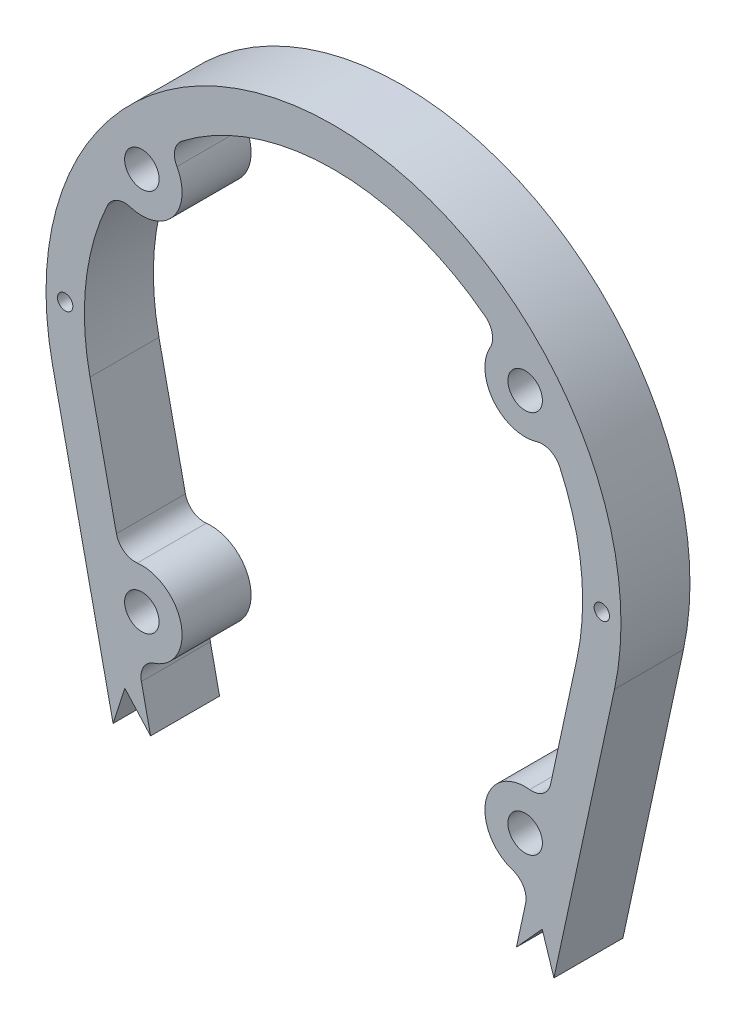
ISO-10303-21;
HEADER;
FILE_DESCRIPTION(('STEP AP214'),'2;1');
FILE_NAME('part.step','',(''),(''),'','','');
FILE_SCHEMA(('AUTOMOTIVE_DESIGN { 1 0 10303 214 1 1 1 1 }'));
ENDSEC;
DATA;
#1=APPLICATION_CONTEXT('core data for automotive mechanical design processes');
#2=APPLICATION_PROTOCOL_DEFINITION('international standard','automotive_design',2000,#1);
#3=PRODUCT_CONTEXT('',#1,'mechanical');
#4=PRODUCT('Part','Part','',(#3));
#5=PRODUCT_RELATED_PRODUCT_CATEGORY('part','',(#4));
#6=PRODUCT_DEFINITION_FORMATION('','',#4);
#7=PRODUCT_DEFINITION_CONTEXT('part definition',#1,'design');
#8=PRODUCT_DEFINITION('design','',#6,#7);
#9=PRODUCT_DEFINITION_SHAPE('','',#8);
#10=(LENGTH_UNIT() NAMED_UNIT(*) SI_UNIT(.MILLI.,.METRE.));
#11=(NAMED_UNIT(*) PLANE_ANGLE_UNIT() SI_UNIT($,.RADIAN.));
#12=(NAMED_UNIT(*) SI_UNIT($,.STERADIAN.) SOLID_ANGLE_UNIT());
#13=UNCERTAINTY_MEASURE_WITH_UNIT(LENGTH_MEASURE(1.E-05),#10,'distance_accuracy_value','');
#14=(GEOMETRIC_REPRESENTATION_CONTEXT(3) GLOBAL_UNCERTAINTY_ASSIGNED_CONTEXT((#13)) GLOBAL_UNIT_ASSIGNED_CONTEXT((#10,
#11,#12)) REPRESENTATION_CONTEXT('',''));
#15=CARTESIAN_POINT('',(0.,0.,0.));
#16=DIRECTION('',(0.,0.,1.));
#17=DIRECTION('',(1.,0.,0.));
#18=AXIS2_PLACEMENT_3D('',#15,#16,#17);
#19=CARTESIAN_POINT('',(-31.9298733487398,-112.5,18.));
#20=DIRECTION('',(0.,0.,1.));
#21=DIRECTION('',(1.,0.,0.));
#22=AXIS2_PLACEMENT_3D('',#19,#20,#21);
#23=PLANE('',#22);
#24=CARTESIAN_POINT('',(70.,47.5,18.));
#25=DIRECTION('',(0.,0.,1.));
#26=DIRECTION('',(1.,0.,0.));
#27=AXIS2_PLACEMENT_3D('',#24,#25,#26);
#28=CIRCLE('',#27,2.);
#29=CARTESIAN_POINT('',(72.,47.5,18.));
#30=VERTEX_POINT('',#29);
#31=EDGE_CURVE('E556',#30,#30,#28,.T.);
#32=ORIENTED_EDGE('',*,*,#31,.F.);
#33=EDGE_LOOP('',(#32));
#34=FACE_BOUND('',#33,.T.);
#35=CARTESIAN_POINT('',(-70.,47.5,18.));
#36=DIRECTION('',(0.,0.,1.));
#37=DIRECTION('',(1.,0.,0.));
#38=AXIS2_PLACEMENT_3D('',#35,#36,#37);
#39=CIRCLE('',#38,2.);
#40=CARTESIAN_POINT('',(-68.,47.5,18.));
#41=VERTEX_POINT('',#40);
#42=EDGE_CURVE('E550',#41,#41,#39,.T.);
#43=ORIENTED_EDGE('',*,*,#42,.F.);
#44=EDGE_LOOP('',(#43));
#45=FACE_BOUND('',#44,.T.);
#46=DIRECTION('',(-0.306753150837407,-0.95178910713,0.));
#47=VECTOR('',#46,1.);
#48=CARTESIAN_POINT('',(-57.5063561450649,-41.4755483598365,18.));
#49=LINE('',#48,#47);
#50=CARTESIAN_POINT('',(-54.4439824625953,-31.9736609139237,18.));
#51=VERTEX_POINT('',#50);
#52=CARTESIAN_POINT('',(-57.5063561450649,-41.4755483598365,18.));
#53=VERTEX_POINT('',#52);
#54=EDGE_CURVE('E215',#51,#53,#49,.T.);
#55=ORIENTED_EDGE('',*,*,#54,.F.);
#56=DIRECTION('',(-0.67089697040122,0.741550574881083,0.));
#57=VECTOR('',#56,1.);
#58=CARTESIAN_POINT('',(-54.4439824625953,-31.9736609139237,18.));
#59=LINE('',#58,#57);
#60=CARTESIAN_POINT('',(-47.7236876934698,-39.4016843948391,18.));
#61=VERTEX_POINT('',#60);
#62=EDGE_CURVE('E541',#61,#51,#59,.T.);
#63=ORIENTED_EDGE('',*,*,#62,.F.);
#64=DIRECTION('',(0.211189373172623,-0.977445164016353,0.));
#65=VECTOR('',#64,1.);
#66=CARTESIAN_POINT('',(-31.9298733487398,-112.5,18.));
#67=LINE('',#66,#65);
#68=CARTESIAN_POINT('',(-50.1212592306133,-28.3050337009208,18.));
#69=VERTEX_POINT('',#68);
#70=EDGE_CURVE('E361',#69,#61,#67,.T.);
#71=ORIENTED_EDGE('',*,*,#70,.F.);
#72=CARTESIAN_POINT('',(-45.2340334105316,-27.2490868350576,18.));
#73=DIRECTION('',(0.,0.,1.));
#74=DIRECTION('',(1.,0.,0.));
#75=AXIS2_PLACEMENT_3D('',#72,#73,#74);
#76=CIRCLE('',#75,5.);
#77=CARTESIAN_POINT('',(-46.7714419877795,-22.4913168882649,18.));
#78=VERTEX_POINT('',#77);
#79=EDGE_CURVE('E303',#69,#78,#76,.F.);
#80=ORIENTED_EDGE('',*,*,#79,.T.);
#81=CARTESIAN_POINT('',(-50.,-12.5,18.));
#82=DIRECTION('',(0.,0.,-1.));
#83=DIRECTION('',(1.,0.,0.));
#84=AXIS2_PLACEMENT_3D('',#81,#82,#83);
#85=CIRCLE('',#84,10.5);
#86=CARTESIAN_POINT('',(-51.1843712947804,-2.06701075261266,18.));
#87=VERTEX_POINT('',#86);
#88=EDGE_CURVE('E358',#87,#78,#85,.T.);
#89=ORIENTED_EDGE('',*,*,#88,.F.);
#90=CARTESIAN_POINT('',(-51.7483576256283,2.90107936519085,18.));
#91=DIRECTION('',(0.,0.,1.));
#92=DIRECTION('',(1.,0.,0.));
#93=AXIS2_PLACEMENT_3D('',#90,#91,#92);
#94=CIRCLE('',#93,5.);
#95=CARTESIAN_POINT('',(-56.63558344571,1.84513249932773,18.));
#96=VERTEX_POINT('',#95);
#97=EDGE_CURVE('E290',#87,#96,#94,.F.);
#98=ORIENTED_EDGE('',*,*,#97,.T.);
#99=DIRECTION('',(0.211189373172623,-0.977445164016353,0.));
#100=VECTOR('',#99,1.);
#101=CARTESIAN_POINT('',(-55.4723236772757,-3.53876830055558,18.));
#102=LINE('',#101,#100);
#103=CARTESIAN_POINT('',(-63.5339356610629,33.7726907437795,18.));
#104=VERTEX_POINT('',#103);
#105=EDGE_CURVE('E349',#104,#96,#102,.T.);
#106=ORIENTED_EDGE('',*,*,#105,.F.);
#107=CARTESIAN_POINT('',(0.,47.5,18.));
#108=DIRECTION('',(0.,0.,1.));
#109=DIRECTION('',(1.,0.,0.));
#110=AXIS2_PLACEMENT_3D('',#107,#108,#109);
#111=CIRCLE('',#110,65.);
#112=CARTESIAN_POINT('',(-59.0097536999229,74.755255791763,18.));
#113=VERTEX_POINT('',#112);
#114=EDGE_CURVE('E343',#113,#104,#111,.T.);
#115=ORIENTED_EDGE('',*,*,#114,.F.);
#116=CARTESIAN_POINT('',(-54.4705418768519,72.6586976539351,18.));
#117=DIRECTION('',(0.,0.,1.));
#118=DIRECTION('',(1.,0.,0.));
#119=AXIS2_PLACEMENT_3D('',#116,#117,#118);
#120=CIRCLE('',#119,5.);
#121=CARTESIAN_POINT('',(-53.0284315939965,77.4462145397625,18.));
#122=VERTEX_POINT('',#121);
#123=EDGE_CURVE('E11',#113,#122,#120,.F.);
#124=ORIENTED_EDGE('',*,*,#123,.T.);
#125=CARTESIAN_POINT('',(-50.,87.5,18.));
#126=DIRECTION('',(0.,0.,-1.));
#127=DIRECTION('',(1.,0.,0.));
#128=AXIS2_PLACEMENT_3D('',#125,#126,#127);
#129=CIRCLE('',#128,10.5);
#130=CARTESIAN_POINT('',(-40.8562064862553,92.661495924439,18.));
#131=VERTEX_POINT('',#130);
#132=EDGE_CURVE('E340',#131,#122,#129,.T.);
#133=ORIENTED_EDGE('',*,*,#132,.F.);
#134=CARTESIAN_POINT('',(-36.5020190987578,95.1193511265528,18.));
#135=DIRECTION('',(0.,0.,1.));
#136=DIRECTION('',(1.,0.,0.));
#137=AXIS2_PLACEMENT_3D('',#134,#135,#136);
#138=CIRCLE('',#137,5.);
#139=CARTESIAN_POINT('',(-39.5438540236543,99.0876303870988,18.));
#140=VERTEX_POINT('',#139);
#141=EDGE_CURVE('E315',#131,#140,#138,.F.);
#142=ORIENTED_EDGE('',*,*,#141,.T.);
#143=CARTESIAN_POINT('',(0.,47.5,18.));
#144=DIRECTION('',(0.,0.,1.));
#145=DIRECTION('',(1.,0.,0.));
#146=AXIS2_PLACEMENT_3D('',#143,#144,#145);
#147=CIRCLE('',#146,65.);
#148=CARTESIAN_POINT('',(39.5438540236543,99.0876303870988,18.));
#149=VERTEX_POINT('',#148);
#150=EDGE_CURVE('E347',#149,#140,#147,.T.);
#151=ORIENTED_EDGE('',*,*,#150,.F.);
#152=CARTESIAN_POINT('',(36.5020190987578,95.1193511265527,18.));
#153=DIRECTION('',(0.,0.,1.));
#154=DIRECTION('',(1.,0.,0.));
#155=AXIS2_PLACEMENT_3D('',#152,#153,#154);
#156=CIRCLE('',#155,5.);
#157=CARTESIAN_POINT('',(40.8562064862553,92.6614959244389,18.));
#158=VERTEX_POINT('',#157);
#159=EDGE_CURVE('E311',#149,#158,#156,.F.);
#160=ORIENTED_EDGE('',*,*,#159,.T.);
#161=CARTESIAN_POINT('',(50.,87.5,18.));
#162=DIRECTION('',(0.,0.,-1.));
#163=DIRECTION('',(1.,0.,0.));
#164=AXIS2_PLACEMENT_3D('',#161,#162,#163);
#165=CIRCLE('',#164,10.5);
#166=CARTESIAN_POINT('',(53.0284315939965,77.4462145397625,18.));
#167=VERTEX_POINT('',#166);
#168=EDGE_CURVE('E352',#167,#158,#165,.T.);
#169=ORIENTED_EDGE('',*,*,#168,.F.);
#170=CARTESIAN_POINT('',(54.470541876852,72.6586976539351,18.));
#171=DIRECTION('',(0.,0.,1.));
#172=DIRECTION('',(1.,0.,0.));
#173=AXIS2_PLACEMENT_3D('',#170,#171,#172);
#174=CIRCLE('',#173,5.);
#175=CARTESIAN_POINT('',(59.009753699923,74.755255791763,18.));
#176=VERTEX_POINT('',#175);
#177=EDGE_CURVE('E307',#167,#176,#174,.F.);
#178=ORIENTED_EDGE('',*,*,#177,.T.);
#179=CARTESIAN_POINT('',(0.,47.5,18.));
#180=DIRECTION('',(0.,0.,1.));
#181=DIRECTION('',(1.,0.,0.));
#182=AXIS2_PLACEMENT_3D('',#179,#180,#181);
#183=CIRCLE('',#182,65.);
#184=CARTESIAN_POINT('',(63.5339356610629,33.7726907437795,18.));
#185=VERTEX_POINT('',#184);
#186=EDGE_CURVE('E443',#185,#176,#183,.T.);
#187=ORIENTED_EDGE('',*,*,#186,.F.);
#188=DIRECTION('',(0.211189373172623,0.977445164016353,0.));
#189=VECTOR('',#188,1.);
#190=CARTESIAN_POINT('',(55.4723236772757,-3.53876830055554,18.));
#191=LINE('',#190,#189);
#192=CARTESIAN_POINT('',(56.63558344571,1.84513249932773,18.));
#193=VERTEX_POINT('',#192);
#194=EDGE_CURVE('E441',#193,#185,#191,.T.);
#195=ORIENTED_EDGE('',*,*,#194,.F.);
#196=CARTESIAN_POINT('',(51.7483576256282,2.90107936519085,18.));
#197=DIRECTION('',(0.,0.,1.));
#198=DIRECTION('',(1.,0.,0.));
#199=AXIS2_PLACEMENT_3D('',#196,#197,#198);
#200=CIRCLE('',#199,5.);
#201=CARTESIAN_POINT('',(51.1843712947804,-2.06701075261265,18.));
#202=VERTEX_POINT('',#201);
#203=EDGE_CURVE('E294',#193,#202,#200,.F.);
#204=ORIENTED_EDGE('',*,*,#203,.T.);
#205=CARTESIAN_POINT('',(50.,-12.5,18.));
#206=DIRECTION('',(0.,0.,-1.));
#207=DIRECTION('',(1.,0.,0.));
#208=AXIS2_PLACEMENT_3D('',#205,#206,#207);
#209=CIRCLE('',#208,10.5);
#210=CARTESIAN_POINT('',(46.7714419877795,-22.4913168882648,18.));
#211=VERTEX_POINT('',#210);
#212=EDGE_CURVE('E391',#211,#202,#209,.T.);
#213=ORIENTED_EDGE('',*,*,#212,.F.);
#214=CARTESIAN_POINT('',(45.2340334105316,-27.2490868350576,18.));
#215=DIRECTION('',(0.,0.,1.));
#216=DIRECTION('',(1.,0.,0.));
#217=AXIS2_PLACEMENT_3D('',#214,#215,#216);
#218=CIRCLE('',#217,5.);
#219=CARTESIAN_POINT('',(50.1212592306133,-28.3050337009207,18.));
#220=VERTEX_POINT('',#219);
#221=EDGE_CURVE('E298',#211,#220,#218,.F.);
#222=ORIENTED_EDGE('',*,*,#221,.T.);
#223=DIRECTION('',(0.211189373172623,0.977445164016353,0.));
#224=VECTOR('',#223,1.);
#225=CARTESIAN_POINT('',(31.9298733487398,-112.5,18.));
#226=LINE('',#225,#224);
#227=CARTESIAN_POINT('',(47.7244032118376,-39.3983727700264,18.));
#228=VERTEX_POINT('',#227);
#229=EDGE_CURVE('E364',#228,#220,#226,.T.);
#230=ORIENTED_EDGE('',*,*,#229,.F.);
#231=DIRECTION('',(-0.670959777554308,-0.741493747043273,0.));
#232=VECTOR('',#231,1.);
#233=CARTESIAN_POINT('',(47.7244032118376,-39.3983727700264,18.));
#234=LINE('',#233,#232);
#235=CARTESIAN_POINT('',(54.4443390688109,-31.9720104377862,18.));
#236=VERTEX_POINT('',#235);
#237=EDGE_CURVE('E55',#236,#228,#234,.T.);
#238=ORIENTED_EDGE('',*,*,#237,.F.);
#239=DIRECTION('',(-0.306672532909785,0.951815085801174,0.));
#240=VECTOR('',#239,1.);
#241=CARTESIAN_POINT('',(54.4443390688109,-31.9720104377862,18.));
#242=LINE('',#241,#240);
#243=CARTESIAN_POINT('',(57.5063561450649,-41.4755483598365,18.));
#244=VERTEX_POINT('',#243);
#245=EDGE_CURVE('E540',#244,#236,#242,.T.);
#246=ORIENTED_EDGE('',*,*,#245,.F.);
#247=DIRECTION('',(0.211189373172623,0.977445164016353,0.));
#248=VECTOR('',#247,1.);
#249=CARTESIAN_POINT('',(41.7043249889033,-114.611893731726,18.));
#250=LINE('',#249,#248);
#251=CARTESIAN_POINT('',(73.3083873012265,31.6607970120533,18.));
#252=VERTEX_POINT('',#251);
#253=EDGE_CURVE('E223',#244,#252,#250,.T.);
#254=ORIENTED_EDGE('',*,*,#253,.T.);
#255=CARTESIAN_POINT('',(0.,47.5,18.));
#256=DIRECTION('',(0.,0.,1.));
#257=DIRECTION('',(1.,0.,0.));
#258=AXIS2_PLACEMENT_3D('',#255,#256,#257);
#259=CIRCLE('',#258,75.);
#260=CARTESIAN_POINT('',(-73.3083873012264,31.6607970120533,18.));
#261=VERTEX_POINT('',#260);
#262=EDGE_CURVE('E416',#252,#261,#259,.T.);
#263=ORIENTED_EDGE('',*,*,#262,.T.);
#264=DIRECTION('',(0.211189373172623,-0.977445164016353,0.));
#265=VECTOR('',#264,1.);
#266=CARTESIAN_POINT('',(-73.3083873012264,31.6607970120533,18.));
#267=LINE('',#266,#265);
#268=EDGE_CURVE('E238',#261,#53,#267,.T.);
#269=ORIENTED_EDGE('',*,*,#268,.T.);
#270=EDGE_LOOP('',(#55,#63,#71,#80,#89,#98,#106,#115,#124,#133,#142,#151,#160,#169,#178,#187,
#195,#204,#213,#222,#230,#238,#246,#254,#263,#269));
#271=FACE_BOUND('',#270,.T.);
#272=CARTESIAN_POINT('',(-50.,87.5,18.));
#273=DIRECTION('',(0.,0.,1.));
#274=DIRECTION('',(1.,0.,0.));
#275=AXIS2_PLACEMENT_3D('',#272,#273,#274);
#276=CIRCLE('',#275,4.5);
#277=CARTESIAN_POINT('',(-45.5,87.5,18.));
#278=VERTEX_POINT('',#277);
#279=EDGE_CURVE('E403',#278,#278,#276,.T.);
#280=ORIENTED_EDGE('',*,*,#279,.F.);
#281=EDGE_LOOP('',(#280));
#282=FACE_BOUND('',#281,.T.);
#283=CARTESIAN_POINT('',(50.,-12.5,18.));
#284=DIRECTION('',(0.,0.,1.));
#285=DIRECTION('',(1.,0.,0.));
#286=AXIS2_PLACEMENT_3D('',#283,#284,#285);
#287=CIRCLE('',#286,4.5);
#288=CARTESIAN_POINT('',(54.5,-12.5,18.));
#289=VERTEX_POINT('',#288);
#290=EDGE_CURVE('E230',#289,#289,#287,.T.);
#291=ORIENTED_EDGE('',*,*,#290,.F.);
#292=EDGE_LOOP('',(#291));
#293=FACE_BOUND('',#292,.T.);
#294=CARTESIAN_POINT('',(50.,87.5,18.));
#295=DIRECTION('',(0.,0.,1.));
#296=DIRECTION('',(1.,0.,0.));
#297=AXIS2_PLACEMENT_3D('',#294,#295,#296);
#298=CIRCLE('',#297,4.5);
#299=CARTESIAN_POINT('',(54.5,87.5,18.));
#300=VERTEX_POINT('',#299);
#301=EDGE_CURVE('E409',#300,#300,#298,.T.);
#302=ORIENTED_EDGE('',*,*,#301,.F.);
#303=EDGE_LOOP('',(#302));
#304=FACE_BOUND('',#303,.T.);
#305=CARTESIAN_POINT('',(-50.,-12.5,18.));
#306=DIRECTION('',(0.,0.,1.));
#307=DIRECTION('',(1.,0.,0.));
#308=AXIS2_PLACEMENT_3D('',#305,#306,#307);
#309=CIRCLE('',#308,4.5);
#310=CARTESIAN_POINT('',(-45.5,-12.5,18.));
#311=VERTEX_POINT('',#310);
#312=EDGE_CURVE('E397',#311,#311,#309,.T.);
#313=ORIENTED_EDGE('',*,*,#312,.F.);
#314=EDGE_LOOP('',(#313));
#315=FACE_BOUND('',#314,.T.);
#316=ADVANCED_FACE('F32',(#34,#45,#271,#282,#293,#304,#315),#23,.T.);
#317=CARTESIAN_POINT('',(-31.9298733487398,-112.5,0.));
#318=DIRECTION('',(0.,0.,1.));
#319=DIRECTION('',(1.,0.,0.));
#320=AXIS2_PLACEMENT_3D('',#317,#318,#319);
#321=PLANE('',#320);
#322=CARTESIAN_POINT('',(70.,47.5,0.));
#323=DIRECTION('',(0.,0.,1.));
#324=DIRECTION('',(1.,0.,0.));
#325=AXIS2_PLACEMENT_3D('',#322,#323,#324);
#326=CIRCLE('',#325,2.);
#327=CARTESIAN_POINT('',(72.,47.5,0.));
#328=VERTEX_POINT('',#327);
#329=EDGE_CURVE('E553',#328,#328,#326,.T.);
#330=ORIENTED_EDGE('',*,*,#329,.T.);
#331=EDGE_LOOP('',(#330));
#332=FACE_BOUND('',#331,.T.);
#333=CARTESIAN_POINT('',(-70.,47.5,0.));
#334=DIRECTION('',(0.,0.,1.));
#335=DIRECTION('',(1.,0.,0.));
#336=AXIS2_PLACEMENT_3D('',#333,#334,#335);
#337=CIRCLE('',#336,2.);
#338=CARTESIAN_POINT('',(-68.,47.5,0.));
#339=VERTEX_POINT('',#338);
#340=EDGE_CURVE('E544',#339,#339,#337,.T.);
#341=ORIENTED_EDGE('',*,*,#340,.T.);
#342=EDGE_LOOP('',(#341));
#343=FACE_BOUND('',#342,.T.);
#344=CARTESIAN_POINT('',(-50.,-12.5,0.));
#345=DIRECTION('',(0.,0.,1.));
#346=DIRECTION('',(1.,0.,0.));
#347=AXIS2_PLACEMENT_3D('',#344,#345,#346);
#348=CIRCLE('',#347,4.5);
#349=CARTESIAN_POINT('',(-45.5,-12.5,0.));
#350=VERTEX_POINT('',#349);
#351=EDGE_CURVE('E396',#350,#350,#348,.T.);
#352=ORIENTED_EDGE('',*,*,#351,.T.);
#353=EDGE_LOOP('',(#352));
#354=FACE_BOUND('',#353,.T.);
#355=CARTESIAN_POINT('',(-50.,87.5,0.));
#356=DIRECTION('',(0.,0.,1.));
#357=DIRECTION('',(1.,0.,0.));
#358=AXIS2_PLACEMENT_3D('',#355,#356,#357);
#359=CIRCLE('',#358,4.5);
#360=CARTESIAN_POINT('',(-45.5,87.5,0.));
#361=VERTEX_POINT('',#360);
#362=EDGE_CURVE('E400',#361,#361,#359,.T.);
#363=ORIENTED_EDGE('',*,*,#362,.T.);
#364=EDGE_LOOP('',(#363));
#365=FACE_BOUND('',#364,.T.);
#366=CARTESIAN_POINT('',(50.,87.5,0.));
#367=DIRECTION('',(0.,0.,1.));
#368=DIRECTION('',(1.,0.,0.));
#369=AXIS2_PLACEMENT_3D('',#366,#367,#368);
#370=CIRCLE('',#369,4.5);
#371=CARTESIAN_POINT('',(54.5,87.5,0.));
#372=VERTEX_POINT('',#371);
#373=EDGE_CURVE('E406',#372,#372,#370,.T.);
#374=ORIENTED_EDGE('',*,*,#373,.T.);
#375=EDGE_LOOP('',(#374));
#376=FACE_BOUND('',#375,.T.);
#377=CARTESIAN_POINT('',(50.,-12.5,0.));
#378=DIRECTION('',(0.,0.,1.));
#379=DIRECTION('',(1.,0.,0.));
#380=AXIS2_PLACEMENT_3D('',#377,#378,#379);
#381=CIRCLE('',#380,4.5);
#382=CARTESIAN_POINT('',(54.5,-12.5,0.));
#383=VERTEX_POINT('',#382);
#384=EDGE_CURVE('E235',#383,#383,#381,.T.);
#385=ORIENTED_EDGE('',*,*,#384,.T.);
#386=EDGE_LOOP('',(#385));
#387=FACE_BOUND('',#386,.T.);
#388=DIRECTION('',(-0.67089697040122,0.741550574881083,0.));
#389=VECTOR('',#388,1.);
#390=CARTESIAN_POINT('',(-54.4439824625953,-31.9736609139237,0.));
#391=LINE('',#390,#389);
#392=CARTESIAN_POINT('',(-47.7236876934698,-39.4016843948391,0.));
#393=VERTEX_POINT('',#392);
#394=CARTESIAN_POINT('',(-54.4439824625953,-31.9736609139237,0.));
#395=VERTEX_POINT('',#394);
#396=EDGE_CURVE('E47',#393,#395,#391,.T.);
#397=ORIENTED_EDGE('',*,*,#396,.T.);
#398=DIRECTION('',(-0.306753150837407,-0.95178910713,0.));
#399=VECTOR('',#398,1.);
#400=CARTESIAN_POINT('',(-57.5063561450649,-41.4755483598365,0.));
#401=LINE('',#400,#399);
#402=CARTESIAN_POINT('',(-57.5063561450649,-41.4755483598365,0.));
#403=VERTEX_POINT('',#402);
#404=EDGE_CURVE('E224',#395,#403,#401,.T.);
#405=ORIENTED_EDGE('',*,*,#404,.T.);
#406=DIRECTION('',(0.211189373172623,-0.977445164016353,0.));
#407=VECTOR('',#406,1.);
#408=CARTESIAN_POINT('',(-73.3083873012264,31.6607970120533,0.));
#409=LINE('',#408,#407);
#410=CARTESIAN_POINT('',(-73.3083873012264,31.6607970120533,0.));
#411=VERTEX_POINT('',#410);
#412=EDGE_CURVE('E232',#411,#403,#409,.T.);
#413=ORIENTED_EDGE('',*,*,#412,.F.);
#414=CARTESIAN_POINT('',(0.,47.5,0.));
#415=DIRECTION('',(0.,0.,1.));
#416=DIRECTION('',(1.,0.,0.));
#417=AXIS2_PLACEMENT_3D('',#414,#415,#416);
#418=CIRCLE('',#417,75.);
#419=CARTESIAN_POINT('',(73.3083873012265,31.6607970120533,0.));
#420=VERTEX_POINT('',#419);
#421=EDGE_CURVE('E229',#420,#411,#418,.T.);
#422=ORIENTED_EDGE('',*,*,#421,.F.);
#423=DIRECTION('',(0.211189373172623,0.977445164016353,0.));
#424=VECTOR('',#423,1.);
#425=CARTESIAN_POINT('',(41.7043249889033,-114.611893731726,0.));
#426=LINE('',#425,#424);
#427=CARTESIAN_POINT('',(57.5063561450649,-41.4755483598365,0.));
#428=VERTEX_POINT('',#427);
#429=EDGE_CURVE('E221',#428,#420,#426,.T.);
#430=ORIENTED_EDGE('',*,*,#429,.F.);
#431=DIRECTION('',(-0.306672532909785,0.951815085801174,0.));
#432=VECTOR('',#431,1.);
#433=CARTESIAN_POINT('',(54.4443390688109,-31.9720104377862,0.));
#434=LINE('',#433,#432);
#435=CARTESIAN_POINT('',(54.4443390688109,-31.9720104377862,0.));
#436=VERTEX_POINT('',#435);
#437=EDGE_CURVE('E203',#428,#436,#434,.T.);
#438=ORIENTED_EDGE('',*,*,#437,.T.);
#439=DIRECTION('',(-0.670959777554308,-0.741493747043273,0.));
#440=VECTOR('',#439,1.);
#441=CARTESIAN_POINT('',(47.7244032118376,-39.3983727700264,0.));
#442=LINE('',#441,#440);
#443=CARTESIAN_POINT('',(47.7244032118376,-39.3983727700264,0.));
#444=VERTEX_POINT('',#443);
#445=EDGE_CURVE('E214',#436,#444,#442,.T.);
#446=ORIENTED_EDGE('',*,*,#445,.T.);
#447=DIRECTION('',(0.211189373172623,0.977445164016353,0.));
#448=VECTOR('',#447,1.);
#449=CARTESIAN_POINT('',(31.9298733487398,-112.5,0.));
#450=LINE('',#449,#448);
#451=CARTESIAN_POINT('',(50.1212592306133,-28.3050337009207,0.));
#452=VERTEX_POINT('',#451);
#453=EDGE_CURVE('E389',#444,#452,#450,.T.);
#454=ORIENTED_EDGE('',*,*,#453,.T.);
#455=CARTESIAN_POINT('',(45.2340334105316,-27.2490868350576,0.));
#456=DIRECTION('',(0.,0.,1.));
#457=DIRECTION('',(1.,0.,0.));
#458=AXIS2_PLACEMENT_3D('',#455,#456,#457);
#459=CIRCLE('',#458,5.);
#460=CARTESIAN_POINT('',(46.7714419877795,-22.4913168882648,0.));
#461=VERTEX_POINT('',#460);
#462=EDGE_CURVE('E296',#452,#461,#459,.T.);
#463=ORIENTED_EDGE('',*,*,#462,.T.);
#464=CARTESIAN_POINT('',(50.,-12.5,0.));
#465=DIRECTION('',(0.,0.,-1.));
#466=DIRECTION('',(1.,0.,0.));
#467=AXIS2_PLACEMENT_3D('',#464,#465,#466);
#468=CIRCLE('',#467,10.5);
#469=CARTESIAN_POINT('',(51.1843712947804,-2.06701075261265,0.));
#470=VERTEX_POINT('',#469);
#471=EDGE_CURVE('E366',#461,#470,#468,.T.);
#472=ORIENTED_EDGE('',*,*,#471,.T.);
#473=CARTESIAN_POINT('',(51.7483576256282,2.90107936519085,0.));
#474=DIRECTION('',(0.,0.,1.));
#475=DIRECTION('',(1.,0.,0.));
#476=AXIS2_PLACEMENT_3D('',#473,#474,#475);
#477=CIRCLE('',#476,5.);
#478=CARTESIAN_POINT('',(56.63558344571,1.84513249932773,0.));
#479=VERTEX_POINT('',#478);
#480=EDGE_CURVE('E292',#470,#479,#477,.T.);
#481=ORIENTED_EDGE('',*,*,#480,.T.);
#482=DIRECTION('',(0.211189373172623,0.977445164016353,0.));
#483=VECTOR('',#482,1.);
#484=CARTESIAN_POINT('',(55.4723236772757,-3.53876830055554,0.));
#485=LINE('',#484,#483);
#486=CARTESIAN_POINT('',(63.5339356610629,33.7726907437795,0.));
#487=VERTEX_POINT('',#486);
#488=EDGE_CURVE('E369',#479,#487,#485,.T.);
#489=ORIENTED_EDGE('',*,*,#488,.T.);
#490=CARTESIAN_POINT('',(0.,47.5,0.));
#491=DIRECTION('',(0.,0.,1.));
#492=DIRECTION('',(1.,0.,0.));
#493=AXIS2_PLACEMENT_3D('',#490,#491,#492);
#494=CIRCLE('',#493,65.);
#495=CARTESIAN_POINT('',(59.009753699923,74.755255791763,0.));
#496=VERTEX_POINT('',#495);
#497=EDGE_CURVE('E372',#487,#496,#494,.T.);
#498=ORIENTED_EDGE('',*,*,#497,.T.);
#499=CARTESIAN_POINT('',(54.470541876852,72.6586976539351,0.));
#500=DIRECTION('',(0.,0.,1.));
#501=DIRECTION('',(1.,0.,0.));
#502=AXIS2_PLACEMENT_3D('',#499,#500,#501);
#503=CIRCLE('',#502,5.);
#504=CARTESIAN_POINT('',(53.0284315939965,77.4462145397625,0.));
#505=VERTEX_POINT('',#504);
#506=EDGE_CURVE('E305',#496,#505,#503,.T.);
#507=ORIENTED_EDGE('',*,*,#506,.T.);
#508=CARTESIAN_POINT('',(50.,87.5,0.));
#509=DIRECTION('',(0.,0.,-1.));
#510=DIRECTION('',(1.,0.,0.));
#511=AXIS2_PLACEMENT_3D('',#508,#509,#510);
#512=CIRCLE('',#511,10.5);
#513=CARTESIAN_POINT('',(40.8562064862553,92.6614959244389,0.));
#514=VERTEX_POINT('',#513);
#515=EDGE_CURVE('E375',#505,#514,#512,.T.);
#516=ORIENTED_EDGE('',*,*,#515,.T.);
#517=CARTESIAN_POINT('',(36.5020190987578,95.1193511265527,0.));
#518=DIRECTION('',(0.,0.,1.));
#519=DIRECTION('',(1.,0.,0.));
#520=AXIS2_PLACEMENT_3D('',#517,#518,#519);
#521=CIRCLE('',#520,5.);
#522=CARTESIAN_POINT('',(39.5438540236543,99.0876303870988,0.));
#523=VERTEX_POINT('',#522);
#524=EDGE_CURVE('E309',#514,#523,#521,.T.);
#525=ORIENTED_EDGE('',*,*,#524,.T.);
#526=CARTESIAN_POINT('',(0.,47.5,0.));
#527=DIRECTION('',(0.,0.,1.));
#528=DIRECTION('',(1.,0.,0.));
#529=AXIS2_PLACEMENT_3D('',#526,#527,#528);
#530=CIRCLE('',#529,65.);
#531=CARTESIAN_POINT('',(-39.5438540236543,99.0876303870988,0.));
#532=VERTEX_POINT('',#531);
#533=EDGE_CURVE('E378',#523,#532,#530,.T.);
#534=ORIENTED_EDGE('',*,*,#533,.T.);
#535=CARTESIAN_POINT('',(-36.5020190987578,95.1193511265528,0.));
#536=DIRECTION('',(0.,0.,1.));
#537=DIRECTION('',(1.,0.,0.));
#538=AXIS2_PLACEMENT_3D('',#535,#536,#537);
#539=CIRCLE('',#538,5.);
#540=CARTESIAN_POINT('',(-40.8562064862553,92.661495924439,0.));
#541=VERTEX_POINT('',#540);
#542=EDGE_CURVE('E313',#532,#541,#539,.T.);
#543=ORIENTED_EDGE('',*,*,#542,.T.);
#544=CARTESIAN_POINT('',(-50.,87.5,0.));
#545=DIRECTION('',(0.,0.,-1.));
#546=DIRECTION('',(1.,0.,0.));
#547=AXIS2_PLACEMENT_3D('',#544,#545,#546);
#548=CIRCLE('',#547,10.5);
#549=CARTESIAN_POINT('',(-53.0284315939965,77.4462145397625,0.));
#550=VERTEX_POINT('',#549);
#551=EDGE_CURVE('E322',#541,#550,#548,.T.);
#552=ORIENTED_EDGE('',*,*,#551,.T.);
#553=CARTESIAN_POINT('',(-54.4705418768519,72.6586976539351,0.));
#554=DIRECTION('',(0.,0.,1.));
#555=DIRECTION('',(1.,0.,0.));
#556=AXIS2_PLACEMENT_3D('',#553,#554,#555);
#557=CIRCLE('',#556,5.);
#558=CARTESIAN_POINT('',(-59.0097536999229,74.755255791763,0.));
#559=VERTEX_POINT('',#558);
#560=EDGE_CURVE('E40',#550,#559,#557,.T.);
#561=ORIENTED_EDGE('',*,*,#560,.T.);
#562=CARTESIAN_POINT('',(0.,47.5,0.));
#563=DIRECTION('',(0.,0.,1.));
#564=DIRECTION('',(1.,0.,0.));
#565=AXIS2_PLACEMENT_3D('',#562,#563,#564);
#566=CIRCLE('',#565,65.);
#567=CARTESIAN_POINT('',(-63.5339356610629,33.7726907437795,0.));
#568=VERTEX_POINT('',#567);
#569=EDGE_CURVE('E319',#559,#568,#566,.T.);
#570=ORIENTED_EDGE('',*,*,#569,.T.);
#571=DIRECTION('',(0.211189373172623,-0.977445164016353,0.));
#572=VECTOR('',#571,1.);
#573=CARTESIAN_POINT('',(-55.4723236772757,-3.53876830055558,0.));
#574=LINE('',#573,#572);
#575=CARTESIAN_POINT('',(-56.63558344571,1.84513249932773,0.));
#576=VERTEX_POINT('',#575);
#577=EDGE_CURVE('E332',#568,#576,#574,.T.);
#578=ORIENTED_EDGE('',*,*,#577,.T.);
#579=CARTESIAN_POINT('',(-51.7483576256283,2.90107936519085,0.));
#580=DIRECTION('',(0.,0.,1.));
#581=DIRECTION('',(1.,0.,0.));
#582=AXIS2_PLACEMENT_3D('',#579,#580,#581);
#583=CIRCLE('',#582,5.);
#584=CARTESIAN_POINT('',(-51.1843712947804,-2.06701075261266,0.));
#585=VERTEX_POINT('',#584);
#586=EDGE_CURVE('E288',#576,#585,#583,.T.);
#587=ORIENTED_EDGE('',*,*,#586,.T.);
#588=CARTESIAN_POINT('',(-50.,-12.5,0.));
#589=DIRECTION('',(0.,0.,-1.));
#590=DIRECTION('',(1.,0.,0.));
#591=AXIS2_PLACEMENT_3D('',#588,#589,#590);
#592=CIRCLE('',#591,10.5);
#593=CARTESIAN_POINT('',(-46.7714419877795,-22.4913168882649,0.));
#594=VERTEX_POINT('',#593);
#595=EDGE_CURVE('E383',#585,#594,#592,.T.);
#596=ORIENTED_EDGE('',*,*,#595,.T.);
#597=CARTESIAN_POINT('',(-45.2340334105316,-27.2490868350576,0.));
#598=DIRECTION('',(0.,0.,1.));
#599=DIRECTION('',(1.,0.,0.));
#600=AXIS2_PLACEMENT_3D('',#597,#598,#599);
#601=CIRCLE('',#600,5.);
#602=CARTESIAN_POINT('',(-50.1212592306133,-28.3050337009208,0.));
#603=VERTEX_POINT('',#602);
#604=EDGE_CURVE('E301',#594,#603,#601,.T.);
#605=ORIENTED_EDGE('',*,*,#604,.T.);
#606=DIRECTION('',(0.211189373172623,-0.977445164016353,0.));
#607=VECTOR('',#606,1.);
#608=CARTESIAN_POINT('',(-31.9298733487398,-112.5,0.));
#609=LINE('',#608,#607);
#610=EDGE_CURVE('E386',#603,#393,#609,.T.);
#611=ORIENTED_EDGE('',*,*,#610,.T.);
#612=EDGE_LOOP('',(#397,#405,#413,#422,#430,#438,#446,#454,#463,#472,#481,#489,#498,#507,#516,
#525,#534,#543,#552,#561,#570,#578,#587,#596,#605,#611));
#613=FACE_BOUND('',#612,.T.);
#614=ADVANCED_FACE('F227',(#332,#343,#354,#365,#376,#387,#613),#321,.F.);
#615=CARTESIAN_POINT('',(41.7043249889033,-114.611893731726,18.));
#616=DIRECTION('',(-0.977445164016353,0.211189373172623,0.));
#617=DIRECTION('',(-0.211189373172623,-0.977445164016353,0.));
#618=AXIS2_PLACEMENT_3D('',#615,#616,#617);
#619=PLANE('',#618);
#620=ORIENTED_EDGE('',*,*,#253,.F.);
#621=DIRECTION('',(0.,0.,1.));
#622=VECTOR('',#621,1.);
#623=CARTESIAN_POINT('',(57.5063561450649,-41.4755483598365,0.));
#624=LINE('',#623,#622);
#625=EDGE_CURVE('E207',#428,#244,#624,.T.);
#626=ORIENTED_EDGE('',*,*,#625,.F.);
#627=ORIENTED_EDGE('',*,*,#429,.T.);
#628=DIRECTION('',(0.,0.,-1.));
#629=VECTOR('',#628,1.);
#630=CARTESIAN_POINT('',(73.3083873012265,31.6607970120533,18.));
#631=LINE('',#630,#629);
#632=EDGE_CURVE('E246',#252,#420,#631,.T.);
#633=ORIENTED_EDGE('',*,*,#632,.F.);
#634=EDGE_LOOP('',(#620,#626,#627,#633));
#635=FACE_BOUND('',#634,.T.);
#636=ADVANCED_FACE('F219',(#635),#619,.F.);
#637=CARTESIAN_POINT('',(0.,47.5,18.));
#638=DIRECTION('',(0.,0.,-1.));
#639=DIRECTION('',(-1.,0.,0.));
#640=AXIS2_PLACEMENT_3D('',#637,#638,#639);
#641=CYLINDRICAL_SURFACE('',#640,75.);
#642=ORIENTED_EDGE('',*,*,#421,.T.);
#643=DIRECTION('',(0.,0.,-1.));
#644=VECTOR('',#643,1.);
#645=CARTESIAN_POINT('',(-73.3083873012264,31.6607970120533,18.));
#646=LINE('',#645,#644);
#647=EDGE_CURVE('E243',#261,#411,#646,.T.);
#648=ORIENTED_EDGE('',*,*,#647,.F.);
#649=ORIENTED_EDGE('',*,*,#262,.F.);
#650=ORIENTED_EDGE('',*,*,#632,.T.);
#651=EDGE_LOOP('',(#642,#648,#649,#650));
#652=FACE_BOUND('',#651,.T.);
#653=ADVANCED_FACE('F489',(#652),#641,.T.);
#654=CARTESIAN_POINT('',(-73.3083873012264,31.6607970120533,18.));
#655=DIRECTION('',(0.977445164016353,0.211189373172623,0.));
#656=DIRECTION('',(-0.211189373172623,0.977445164016353,0.));
#657=AXIS2_PLACEMENT_3D('',#654,#655,#656);
#658=PLANE('',#657);
#659=ORIENTED_EDGE('',*,*,#412,.T.);
#660=DIRECTION('',(0.,0.,1.));
#661=VECTOR('',#660,1.);
#662=CARTESIAN_POINT('',(-57.5063561450649,-41.4755483598365,0.));
#663=LINE('',#662,#661);
#664=EDGE_CURVE('E370',#403,#53,#663,.T.);
#665=ORIENTED_EDGE('',*,*,#664,.T.);
#666=ORIENTED_EDGE('',*,*,#268,.F.);
#667=ORIENTED_EDGE('',*,*,#647,.T.);
#668=EDGE_LOOP('',(#659,#665,#666,#667));
#669=FACE_BOUND('',#668,.T.);
#670=ADVANCED_FACE('F424',(#669),#658,.F.);
#671=CARTESIAN_POINT('',(50.,-12.5,18.));
#672=DIRECTION('',(0.,0.,-1.));
#673=DIRECTION('',(-1.,0.,0.));
#674=AXIS2_PLACEMENT_3D('',#671,#672,#673);
#675=CYLINDRICAL_SURFACE('',#674,4.5);
#676=ORIENTED_EDGE('',*,*,#290,.T.);
#677=EDGE_LOOP('',(#676));
#678=FACE_BOUND('',#677,.T.);
#679=ORIENTED_EDGE('',*,*,#384,.F.);
#680=EDGE_LOOP('',(#679));
#681=FACE_BOUND('',#680,.T.);
#682=ADVANCED_FACE('F484',(#678,#681),#675,.F.);
#683=CARTESIAN_POINT('',(50.,87.5,18.));
#684=DIRECTION('',(0.,0.,-1.));
#685=DIRECTION('',(-1.,0.,0.));
#686=AXIS2_PLACEMENT_3D('',#683,#684,#685);
#687=CYLINDRICAL_SURFACE('',#686,4.5);
#688=ORIENTED_EDGE('',*,*,#301,.T.);
#689=EDGE_LOOP('',(#688));
#690=FACE_BOUND('',#689,.T.);
#691=ORIENTED_EDGE('',*,*,#373,.F.);
#692=EDGE_LOOP('',(#691));
#693=FACE_BOUND('',#692,.T.);
#694=ADVANCED_FACE('F618',(#690,#693),#687,.F.);
#695=CARTESIAN_POINT('',(-50.,87.5,18.));
#696=DIRECTION('',(0.,0.,-1.));
#697=DIRECTION('',(-1.,0.,0.));
#698=AXIS2_PLACEMENT_3D('',#695,#696,#697);
#699=CYLINDRICAL_SURFACE('',#698,4.5);
#700=ORIENTED_EDGE('',*,*,#279,.T.);
#701=EDGE_LOOP('',(#700));
#702=FACE_BOUND('',#701,.T.);
#703=ORIENTED_EDGE('',*,*,#362,.F.);
#704=EDGE_LOOP('',(#703));
#705=FACE_BOUND('',#704,.T.);
#706=ADVANCED_FACE('F615',(#702,#705),#699,.F.);
#707=CARTESIAN_POINT('',(-50.,-12.5,18.));
#708=DIRECTION('',(0.,0.,-1.));
#709=DIRECTION('',(-1.,0.,0.));
#710=AXIS2_PLACEMENT_3D('',#707,#708,#709);
#711=CYLINDRICAL_SURFACE('',#710,4.5);
#712=ORIENTED_EDGE('',*,*,#312,.T.);
#713=EDGE_LOOP('',(#712));
#714=FACE_BOUND('',#713,.T.);
#715=ORIENTED_EDGE('',*,*,#351,.F.);
#716=EDGE_LOOP('',(#715));
#717=FACE_BOUND('',#716,.T.);
#718=ADVANCED_FACE('F612',(#714,#717),#711,.F.);
#719=CARTESIAN_POINT('',(50.,-12.5,18.));
#720=DIRECTION('',(0.,0.,-1.));
#721=DIRECTION('',(-1.,0.,0.));
#722=AXIS2_PLACEMENT_3D('',#719,#720,#721);
#723=CYLINDRICAL_SURFACE('',#722,10.5);
#724=ORIENTED_EDGE('',*,*,#212,.T.);
#725=DIRECTION('',(0.,0.,-1.));
#726=VECTOR('',#725,1.);
#727=CARTESIAN_POINT('',(51.1843712947804,-2.06701075261265,18.));
#728=LINE('',#727,#726);
#729=EDGE_CURVE('E258',#202,#470,#728,.T.);
#730=ORIENTED_EDGE('',*,*,#729,.T.);
#731=ORIENTED_EDGE('',*,*,#471,.F.);
#732=DIRECTION('',(0.,0.,-1.));
#733=VECTOR('',#732,1.);
#734=CARTESIAN_POINT('',(46.7714419877795,-22.4913168882648,18.));
#735=LINE('',#734,#733);
#736=EDGE_CURVE('E256',#461,#211,#735,.F.);
#737=ORIENTED_EDGE('',*,*,#736,.T.);
#738=EDGE_LOOP('',(#724,#730,#731,#737));
#739=FACE_BOUND('',#738,.T.);
#740=ADVANCED_FACE('F532',(#739),#723,.T.);
#741=CARTESIAN_POINT('',(55.4723236772757,-3.53876830055554,18.));
#742=DIRECTION('',(-0.977445164016353,0.211189373172623,0.));
#743=DIRECTION('',(-0.211189373172623,-0.977445164016353,0.));
#744=AXIS2_PLACEMENT_3D('',#741,#742,#743);
#745=PLANE('',#744);
#746=ORIENTED_EDGE('',*,*,#488,.F.);
#747=DIRECTION('',(0.,0.,1.));
#748=VECTOR('',#747,1.);
#749=CARTESIAN_POINT('',(56.63558344571,1.84513249932774,18.));
#750=LINE('',#749,#748);
#751=EDGE_CURVE('E261',#479,#193,#750,.T.);
#752=ORIENTED_EDGE('',*,*,#751,.T.);
#753=ORIENTED_EDGE('',*,*,#194,.T.);
#754=DIRECTION('',(0.,0.,-1.));
#755=VECTOR('',#754,1.);
#756=CARTESIAN_POINT('',(63.5339356610629,33.7726907437795,18.));
#757=LINE('',#756,#755);
#758=EDGE_CURVE('E393',#185,#487,#757,.T.);
#759=ORIENTED_EDGE('',*,*,#758,.T.);
#760=EDGE_LOOP('',(#746,#752,#753,#759));
#761=FACE_BOUND('',#760,.T.);
#762=ADVANCED_FACE('F525',(#761),#745,.T.);
#763=CARTESIAN_POINT('',(0.,47.5,18.));
#764=DIRECTION('',(0.,0.,-1.));
#765=DIRECTION('',(-1.,0.,0.));
#766=AXIS2_PLACEMENT_3D('',#763,#764,#765);
#767=CYLINDRICAL_SURFACE('',#766,65.);
#768=ORIENTED_EDGE('',*,*,#186,.T.);
#769=DIRECTION('',(0.,0.,-1.));
#770=VECTOR('',#769,1.);
#771=CARTESIAN_POINT('',(59.009753699923,74.755255791763,18.));
#772=LINE('',#771,#770);
#773=EDGE_CURVE('E268',#176,#496,#772,.T.);
#774=ORIENTED_EDGE('',*,*,#773,.T.);
#775=ORIENTED_EDGE('',*,*,#497,.F.);
#776=ORIENTED_EDGE('',*,*,#758,.F.);
#777=EDGE_LOOP('',(#768,#774,#775,#776));
#778=FACE_BOUND('',#777,.T.);
#779=ADVANCED_FACE('F521',(#778),#767,.F.);
#780=CARTESIAN_POINT('',(50.,87.5,18.));
#781=DIRECTION('',(0.,0.,-1.));
#782=DIRECTION('',(-1.,0.,0.));
#783=AXIS2_PLACEMENT_3D('',#780,#781,#782);
#784=CYLINDRICAL_SURFACE('',#783,10.5);
#785=ORIENTED_EDGE('',*,*,#515,.F.);
#786=DIRECTION('',(0.,0.,-1.));
#787=VECTOR('',#786,1.);
#788=CARTESIAN_POINT('',(53.0284315939965,77.4462145397625,18.));
#789=LINE('',#788,#787);
#790=EDGE_CURVE('E274',#505,#167,#789,.F.);
#791=ORIENTED_EDGE('',*,*,#790,.T.);
#792=ORIENTED_EDGE('',*,*,#168,.T.);
#793=DIRECTION('',(0.,0.,-1.));
#794=VECTOR('',#793,1.);
#795=CARTESIAN_POINT('',(40.8562064862553,92.6614959244389,18.));
#796=LINE('',#795,#794);
#797=EDGE_CURVE('E271',#158,#514,#796,.T.);
#798=ORIENTED_EDGE('',*,*,#797,.T.);
#799=EDGE_LOOP('',(#785,#791,#792,#798));
#800=FACE_BOUND('',#799,.T.);
#801=ADVANCED_FACE('F450',(#800),#784,.T.);
#802=CARTESIAN_POINT('',(0.,47.5,18.));
#803=DIRECTION('',(0.,0.,-1.));
#804=DIRECTION('',(-1.,0.,0.));
#805=AXIS2_PLACEMENT_3D('',#802,#803,#804);
#806=CYLINDRICAL_SURFACE('',#805,65.);
#807=ORIENTED_EDGE('',*,*,#533,.F.);
#808=DIRECTION('',(0.,0.,-1.));
#809=VECTOR('',#808,1.);
#810=CARTESIAN_POINT('',(39.5438540236543,99.0876303870988,18.));
#811=LINE('',#810,#809);
#812=EDGE_CURVE('E279',#523,#149,#811,.F.);
#813=ORIENTED_EDGE('',*,*,#812,.T.);
#814=ORIENTED_EDGE('',*,*,#150,.T.);
#815=DIRECTION('',(0.,0.,-1.));
#816=VECTOR('',#815,1.);
#817=CARTESIAN_POINT('',(-39.5438540236543,99.0876303870988,18.));
#818=LINE('',#817,#816);
#819=EDGE_CURVE('E276',#140,#532,#818,.T.);
#820=ORIENTED_EDGE('',*,*,#819,.T.);
#821=EDGE_LOOP('',(#807,#813,#814,#820));
#822=FACE_BOUND('',#821,.T.);
#823=ADVANCED_FACE('F459',(#822),#806,.F.);
#824=CARTESIAN_POINT('',(-50.,87.5,18.));
#825=DIRECTION('',(0.,0.,-1.));
#826=DIRECTION('',(-1.,0.,0.));
#827=AXIS2_PLACEMENT_3D('',#824,#825,#826);
#828=CYLINDRICAL_SURFACE('',#827,10.5);
#829=ORIENTED_EDGE('',*,*,#551,.F.);
#830=DIRECTION('',(0.,0.,-1.));
#831=VECTOR('',#830,1.);
#832=CARTESIAN_POINT('',(-40.8562064862553,92.661495924439,18.));
#833=LINE('',#832,#831);
#834=EDGE_CURVE('E284',#541,#131,#833,.F.);
#835=ORIENTED_EDGE('',*,*,#834,.T.);
#836=ORIENTED_EDGE('',*,*,#132,.T.);
#837=DIRECTION('',(0.,0.,-1.));
#838=VECTOR('',#837,1.);
#839=CARTESIAN_POINT('',(-53.0284315939965,77.4462145397625,18.));
#840=LINE('',#839,#838);
#841=EDGE_CURVE('E281',#122,#550,#840,.T.);
#842=ORIENTED_EDGE('',*,*,#841,.T.);
#843=EDGE_LOOP('',(#829,#835,#836,#842));
#844=FACE_BOUND('',#843,.T.);
#845=ADVANCED_FACE('F345',(#844),#828,.T.);
#846=CARTESIAN_POINT('',(0.,47.5,18.));
#847=DIRECTION('',(0.,0.,-1.));
#848=DIRECTION('',(-1.,0.,0.));
#849=AXIS2_PLACEMENT_3D('',#846,#847,#848);
#850=CYLINDRICAL_SURFACE('',#849,65.);
#851=ORIENTED_EDGE('',*,*,#569,.F.);
#852=DIRECTION('',(0.,0.,-1.));
#853=VECTOR('',#852,1.);
#854=CARTESIAN_POINT('',(-59.0097536999229,74.755255791763,18.));
#855=LINE('',#854,#853);
#856=EDGE_CURVE('E286',#559,#113,#855,.F.);
#857=ORIENTED_EDGE('',*,*,#856,.T.);
#858=ORIENTED_EDGE('',*,*,#114,.T.);
#859=DIRECTION('',(0.,0.,-1.));
#860=VECTOR('',#859,1.);
#861=CARTESIAN_POINT('',(-63.5339356610629,33.7726907437795,18.));
#862=LINE('',#861,#860);
#863=EDGE_CURVE('E330',#104,#568,#862,.T.);
#864=ORIENTED_EDGE('',*,*,#863,.T.);
#865=EDGE_LOOP('',(#851,#857,#858,#864));
#866=FACE_BOUND('',#865,.T.);
#867=ADVANCED_FACE('F327',(#866),#850,.F.);
#868=CARTESIAN_POINT('',(-55.4723236772757,-3.53876830055558,18.));
#869=DIRECTION('',(0.977445164016353,0.211189373172623,0.));
#870=DIRECTION('',(-0.211189373172623,0.977445164016353,0.));
#871=AXIS2_PLACEMENT_3D('',#868,#869,#870);
#872=PLANE('',#871);
#873=ORIENTED_EDGE('',*,*,#105,.T.);
#874=DIRECTION('',(0.,0.,1.));
#875=VECTOR('',#874,1.);
#876=CARTESIAN_POINT('',(-56.63558344571,1.84513249932773,0.));
#877=LINE('',#876,#875);
#878=EDGE_CURVE('E248',#96,#576,#877,.F.);
#879=ORIENTED_EDGE('',*,*,#878,.T.);
#880=ORIENTED_EDGE('',*,*,#577,.F.);
#881=ORIENTED_EDGE('',*,*,#863,.F.);
#882=EDGE_LOOP('',(#873,#879,#880,#881));
#883=FACE_BOUND('',#882,.T.);
#884=ADVANCED_FACE('F593',(#883),#872,.T.);
#885=CARTESIAN_POINT('',(-50.,-12.5,18.));
#886=DIRECTION('',(0.,0.,-1.));
#887=DIRECTION('',(-1.,0.,0.));
#888=AXIS2_PLACEMENT_3D('',#885,#886,#887);
#889=CYLINDRICAL_SURFACE('',#888,10.5);
#890=ORIENTED_EDGE('',*,*,#595,.F.);
#891=DIRECTION('',(0.,0.,-1.));
#892=VECTOR('',#891,1.);
#893=CARTESIAN_POINT('',(-51.1843712947804,-2.06701075261265,18.));
#894=LINE('',#893,#892);
#895=EDGE_CURVE('E254',#585,#87,#894,.F.);
#896=ORIENTED_EDGE('',*,*,#895,.T.);
#897=ORIENTED_EDGE('',*,*,#88,.T.);
#898=DIRECTION('',(0.,0.,-1.));
#899=VECTOR('',#898,1.);
#900=CARTESIAN_POINT('',(-46.7714419877795,-22.4913168882649,18.));
#901=LINE('',#900,#899);
#902=EDGE_CURVE('E251',#78,#594,#901,.T.);
#903=ORIENTED_EDGE('',*,*,#902,.T.);
#904=EDGE_LOOP('',(#890,#896,#897,#903));
#905=FACE_BOUND('',#904,.T.);
#906=ADVANCED_FACE('F589',(#905),#889,.T.);
#907=CARTESIAN_POINT('',(-31.9298733487398,-112.5,18.));
#908=DIRECTION('',(0.977445164016353,0.211189373172623,0.));
#909=DIRECTION('',(-0.211189373172623,0.977445164016353,0.));
#910=AXIS2_PLACEMENT_3D('',#907,#908,#909);
#911=PLANE('',#910);
#912=DIRECTION('',(0.,0.,1.));
#913=VECTOR('',#912,1.);
#914=CARTESIAN_POINT('',(-47.7236876934698,-39.4016843948391,0.));
#915=LINE('',#914,#913);
#916=EDGE_CURVE('E430',#393,#61,#915,.T.);
#917=ORIENTED_EDGE('',*,*,#916,.F.);
#918=ORIENTED_EDGE('',*,*,#610,.F.);
#919=DIRECTION('',(0.,0.,1.));
#920=VECTOR('',#919,1.);
#921=CARTESIAN_POINT('',(-50.1212592306134,-28.3050337009208,18.));
#922=LINE('',#921,#920);
#923=EDGE_CURVE('E266',#603,#69,#922,.T.);
#924=ORIENTED_EDGE('',*,*,#923,.T.);
#925=ORIENTED_EDGE('',*,*,#70,.T.);
#926=EDGE_LOOP('',(#917,#918,#924,#925));
#927=FACE_BOUND('',#926,.T.);
#928=ADVANCED_FACE('F586',(#927),#911,.T.);
#929=CARTESIAN_POINT('',(31.9298733487398,-112.5,18.));
#930=DIRECTION('',(-0.977445164016353,0.211189373172623,0.));
#931=DIRECTION('',(-0.211189373172623,-0.977445164016353,0.));
#932=AXIS2_PLACEMENT_3D('',#929,#930,#931);
#933=PLANE('',#932);
#934=DIRECTION('',(0.,0.,1.));
#935=VECTOR('',#934,1.);
#936=CARTESIAN_POINT('',(47.7244032118376,-39.3983727700264,0.));
#937=LINE('',#936,#935);
#938=EDGE_CURVE('E436',#444,#228,#937,.T.);
#939=ORIENTED_EDGE('',*,*,#938,.T.);
#940=ORIENTED_EDGE('',*,*,#229,.T.);
#941=DIRECTION('',(0.,0.,1.));
#942=VECTOR('',#941,1.);
#943=CARTESIAN_POINT('',(50.1212592306133,-28.3050337009207,0.));
#944=LINE('',#943,#942);
#945=EDGE_CURVE('E263',#220,#452,#944,.F.);
#946=ORIENTED_EDGE('',*,*,#945,.T.);
#947=ORIENTED_EDGE('',*,*,#453,.F.);
#948=EDGE_LOOP('',(#939,#940,#946,#947));
#949=FACE_BOUND('',#948,.T.);
#950=ADVANCED_FACE('F499',(#949),#933,.T.);
#951=CARTESIAN_POINT('',(-51.7483576256283,2.90107936519085,18.));
#952=DIRECTION('',(0.,0.,-1.));
#953=DIRECTION('',(-1.,0.,0.));
#954=AXIS2_PLACEMENT_3D('',#951,#952,#953);
#955=CYLINDRICAL_SURFACE('',#954,5.);
#956=ORIENTED_EDGE('',*,*,#97,.F.);
#957=ORIENTED_EDGE('',*,*,#895,.F.);
#958=ORIENTED_EDGE('',*,*,#586,.F.);
#959=ORIENTED_EDGE('',*,*,#878,.F.);
#960=EDGE_LOOP('',(#956,#957,#958,#959));
#961=FACE_BOUND('',#960,.T.);
#962=ADVANCED_FACE('F495',(#961),#955,.F.);
#963=CARTESIAN_POINT('',(51.7483576256282,2.90107936519085,18.));
#964=DIRECTION('',(0.,0.,-1.));
#965=DIRECTION('',(-1.,0.,0.));
#966=AXIS2_PLACEMENT_3D('',#963,#964,#965);
#967=CYLINDRICAL_SURFACE('',#966,5.);
#968=ORIENTED_EDGE('',*,*,#203,.F.);
#969=ORIENTED_EDGE('',*,*,#751,.F.);
#970=ORIENTED_EDGE('',*,*,#480,.F.);
#971=ORIENTED_EDGE('',*,*,#729,.F.);
#972=EDGE_LOOP('',(#968,#969,#970,#971));
#973=FACE_BOUND('',#972,.T.);
#974=ADVANCED_FACE('F498',(#973),#967,.F.);
#975=CARTESIAN_POINT('',(45.2340334105316,-27.2490868350576,18.));
#976=DIRECTION('',(0.,0.,-1.));
#977=DIRECTION('',(-1.,0.,0.));
#978=AXIS2_PLACEMENT_3D('',#975,#976,#977);
#979=CYLINDRICAL_SURFACE('',#978,5.);
#980=ORIENTED_EDGE('',*,*,#221,.F.);
#981=ORIENTED_EDGE('',*,*,#736,.F.);
#982=ORIENTED_EDGE('',*,*,#462,.F.);
#983=ORIENTED_EDGE('',*,*,#945,.F.);
#984=EDGE_LOOP('',(#980,#981,#982,#983));
#985=FACE_BOUND('',#984,.T.);
#986=ADVANCED_FACE('F503',(#985),#979,.F.);
#987=CARTESIAN_POINT('',(-45.2340334105316,-27.2490868350576,18.));
#988=DIRECTION('',(0.,0.,-1.));
#989=DIRECTION('',(-1.,0.,0.));
#990=AXIS2_PLACEMENT_3D('',#987,#988,#989);
#991=CYLINDRICAL_SURFACE('',#990,5.);
#992=ORIENTED_EDGE('',*,*,#79,.F.);
#993=ORIENTED_EDGE('',*,*,#923,.F.);
#994=ORIENTED_EDGE('',*,*,#604,.F.);
#995=ORIENTED_EDGE('',*,*,#902,.F.);
#996=EDGE_LOOP('',(#992,#993,#994,#995));
#997=FACE_BOUND('',#996,.T.);
#998=ADVANCED_FACE('F507',(#997),#991,.F.);
#999=CARTESIAN_POINT('',(54.470541876852,72.6586976539351,18.));
#1000=DIRECTION('',(0.,0.,-1.));
#1001=DIRECTION('',(-1.,0.,0.));
#1002=AXIS2_PLACEMENT_3D('',#999,#1000,#1001);
#1003=CYLINDRICAL_SURFACE('',#1002,5.);
#1004=ORIENTED_EDGE('',*,*,#177,.F.);
#1005=ORIENTED_EDGE('',*,*,#790,.F.);
#1006=ORIENTED_EDGE('',*,*,#506,.F.);
#1007=ORIENTED_EDGE('',*,*,#773,.F.);
#1008=EDGE_LOOP('',(#1004,#1005,#1006,#1007));
#1009=FACE_BOUND('',#1008,.T.);
#1010=ADVANCED_FACE('F470',(#1009),#1003,.F.);
#1011=CARTESIAN_POINT('',(36.5020190987578,95.1193511265527,18.));
#1012=DIRECTION('',(0.,0.,-1.));
#1013=DIRECTION('',(-1.,0.,0.));
#1014=AXIS2_PLACEMENT_3D('',#1011,#1012,#1013);
#1015=CYLINDRICAL_SURFACE('',#1014,5.);
#1016=ORIENTED_EDGE('',*,*,#159,.F.);
#1017=ORIENTED_EDGE('',*,*,#812,.F.);
#1018=ORIENTED_EDGE('',*,*,#524,.F.);
#1019=ORIENTED_EDGE('',*,*,#797,.F.);
#1020=EDGE_LOOP('',(#1016,#1017,#1018,#1019));
#1021=FACE_BOUND('',#1020,.T.);
#1022=ADVANCED_FACE('F455',(#1021),#1015,.F.);
#1023=CARTESIAN_POINT('',(-36.5020190987578,95.1193511265528,18.));
#1024=DIRECTION('',(0.,0.,-1.));
#1025=DIRECTION('',(-1.,0.,0.));
#1026=AXIS2_PLACEMENT_3D('',#1023,#1024,#1025);
#1027=CYLINDRICAL_SURFACE('',#1026,5.);
#1028=ORIENTED_EDGE('',*,*,#141,.F.);
#1029=ORIENTED_EDGE('',*,*,#834,.F.);
#1030=ORIENTED_EDGE('',*,*,#542,.F.);
#1031=ORIENTED_EDGE('',*,*,#819,.F.);
#1032=EDGE_LOOP('',(#1028,#1029,#1030,#1031));
#1033=FACE_BOUND('',#1032,.T.);
#1034=ADVANCED_FACE('F463',(#1033),#1027,.F.);
#1035=CARTESIAN_POINT('',(-54.4705418768519,72.6586976539351,18.));
#1036=DIRECTION('',(0.,0.,-1.));
#1037=DIRECTION('',(-1.,0.,0.));
#1038=AXIS2_PLACEMENT_3D('',#1035,#1036,#1037);
#1039=CYLINDRICAL_SURFACE('',#1038,5.);
#1040=ORIENTED_EDGE('',*,*,#123,.F.);
#1041=ORIENTED_EDGE('',*,*,#856,.F.);
#1042=ORIENTED_EDGE('',*,*,#560,.F.);
#1043=ORIENTED_EDGE('',*,*,#841,.F.);
#1044=EDGE_LOOP('',(#1040,#1041,#1042,#1043));
#1045=FACE_BOUND('',#1044,.T.);
#1046=ADVANCED_FACE('F34',(#1045),#1039,.F.);
#1047=CARTESIAN_POINT('',(47.7244032118376,-39.3983727700264,0.));
#1048=DIRECTION('',(-0.741493747043273,0.670959777554308,0.));
#1049=DIRECTION('',(-0.670959777554308,-0.741493747043273,0.));
#1050=AXIS2_PLACEMENT_3D('',#1047,#1048,#1049);
#1051=PLANE('',#1050);
#1052=ORIENTED_EDGE('',*,*,#237,.T.);
#1053=ORIENTED_EDGE('',*,*,#938,.F.);
#1054=ORIENTED_EDGE('',*,*,#445,.F.);
#1055=DIRECTION('',(0.,0.,1.));
#1056=VECTOR('',#1055,1.);
#1057=CARTESIAN_POINT('',(54.4443390688109,-31.9720104377862,0.));
#1058=LINE('',#1057,#1056);
#1059=EDGE_CURVE('E209',#436,#236,#1058,.T.);
#1060=ORIENTED_EDGE('',*,*,#1059,.T.);
#1061=EDGE_LOOP('',(#1052,#1053,#1054,#1060));
#1062=FACE_BOUND('',#1061,.T.);
#1063=ADVANCED_FACE('F469',(#1062),#1051,.F.);
#1064=CARTESIAN_POINT('',(54.4443390688109,-31.9720104377862,0.));
#1065=DIRECTION('',(0.951815085801174,0.306672532909785,0.));
#1066=DIRECTION('',(-0.306672532909785,0.951815085801174,0.));
#1067=AXIS2_PLACEMENT_3D('',#1064,#1065,#1066);
#1068=PLANE('',#1067);
#1069=ORIENTED_EDGE('',*,*,#245,.T.);
#1070=ORIENTED_EDGE('',*,*,#1059,.F.);
#1071=ORIENTED_EDGE('',*,*,#437,.F.);
#1072=ORIENTED_EDGE('',*,*,#625,.T.);
#1073=EDGE_LOOP('',(#1069,#1070,#1071,#1072));
#1074=FACE_BOUND('',#1073,.T.);
#1075=ADVANCED_FACE('F206',(#1074),#1068,.F.);
#1076=CARTESIAN_POINT('',(-57.5063561450649,-41.4755483598365,0.));
#1077=DIRECTION('',(-0.95178910713,0.306753150837407,0.));
#1078=DIRECTION('',(-0.306753150837407,-0.95178910713,0.));
#1079=AXIS2_PLACEMENT_3D('',#1076,#1077,#1078);
#1080=PLANE('',#1079);
#1081=ORIENTED_EDGE('',*,*,#54,.T.);
#1082=ORIENTED_EDGE('',*,*,#664,.F.);
#1083=ORIENTED_EDGE('',*,*,#404,.F.);
#1084=DIRECTION('',(0.,0.,1.));
#1085=VECTOR('',#1084,1.);
#1086=CARTESIAN_POINT('',(-54.4439824625953,-31.9736609139237,0.));
#1087=LINE('',#1086,#1085);
#1088=EDGE_CURVE('E428',#395,#51,#1087,.T.);
#1089=ORIENTED_EDGE('',*,*,#1088,.T.);
#1090=EDGE_LOOP('',(#1081,#1082,#1083,#1089));
#1091=FACE_BOUND('',#1090,.T.);
#1092=ADVANCED_FACE('F575',(#1091),#1080,.F.);
#1093=CARTESIAN_POINT('',(-54.4439824625953,-31.9736609139237,0.));
#1094=DIRECTION('',(0.741550574881083,0.670896970401219,0.));
#1095=DIRECTION('',(-0.67089697040122,0.741550574881083,0.));
#1096=AXIS2_PLACEMENT_3D('',#1093,#1094,#1095);
#1097=PLANE('',#1096);
#1098=ORIENTED_EDGE('',*,*,#62,.T.);
#1099=ORIENTED_EDGE('',*,*,#1088,.F.);
#1100=ORIENTED_EDGE('',*,*,#396,.F.);
#1101=ORIENTED_EDGE('',*,*,#916,.T.);
#1102=EDGE_LOOP('',(#1098,#1099,#1100,#1101));
#1103=FACE_BOUND('',#1102,.T.);
#1104=ADVANCED_FACE('F571',(#1103),#1097,.F.);
#1105=CARTESIAN_POINT('',(-70.,47.5,0.));
#1106=DIRECTION('',(0.,0.,1.));
#1107=DIRECTION('',(1.,0.,0.));
#1108=AXIS2_PLACEMENT_3D('',#1105,#1106,#1107);
#1109=CYLINDRICAL_SURFACE('',#1108,2.);
#1110=ORIENTED_EDGE('',*,*,#340,.F.);
#1111=EDGE_LOOP('',(#1110));
#1112=FACE_BOUND('',#1111,.T.);
#1113=ORIENTED_EDGE('',*,*,#42,.T.);
#1114=EDGE_LOOP('',(#1113));
#1115=FACE_BOUND('',#1114,.T.);
#1116=ADVANCED_FACE('F566',(#1112,#1115),#1109,.F.);
#1117=CARTESIAN_POINT('',(70.,47.5,0.));
#1118=DIRECTION('',(0.,0.,1.));
#1119=DIRECTION('',(1.,0.,0.));
#1120=AXIS2_PLACEMENT_3D('',#1117,#1118,#1119);
#1121=CYLINDRICAL_SURFACE('',#1120,2.);
#1122=ORIENTED_EDGE('',*,*,#329,.F.);
#1123=EDGE_LOOP('',(#1122));
#1124=FACE_BOUND('',#1123,.T.);
#1125=ORIENTED_EDGE('',*,*,#31,.T.);
#1126=EDGE_LOOP('',(#1125));
#1127=FACE_BOUND('',#1126,.T.);
#1128=ADVANCED_FACE('F563',(#1124,#1127),#1121,.F.);
#1129=CLOSED_SHELL('',(#316,#614,#636,#653,#670,#682,#694,#706,#718,#740,#762,#779,#801,#823,
#845,#867,#884,#906,#928,#950,#962,#974,#986,#998,#1010,#1022,#1034,#1046,#1063,#1075,#1092,
#1104,#1116,#1128));
#1130=MANIFOLD_SOLID_BREP('B2',#1129);
#1131=ADVANCED_BREP_SHAPE_REPRESENTATION('',(#18,#1130),#14);
#1132=SHAPE_DEFINITION_REPRESENTATION(#9,#1131);
ENDSEC;
END-ISO-10303-21;
